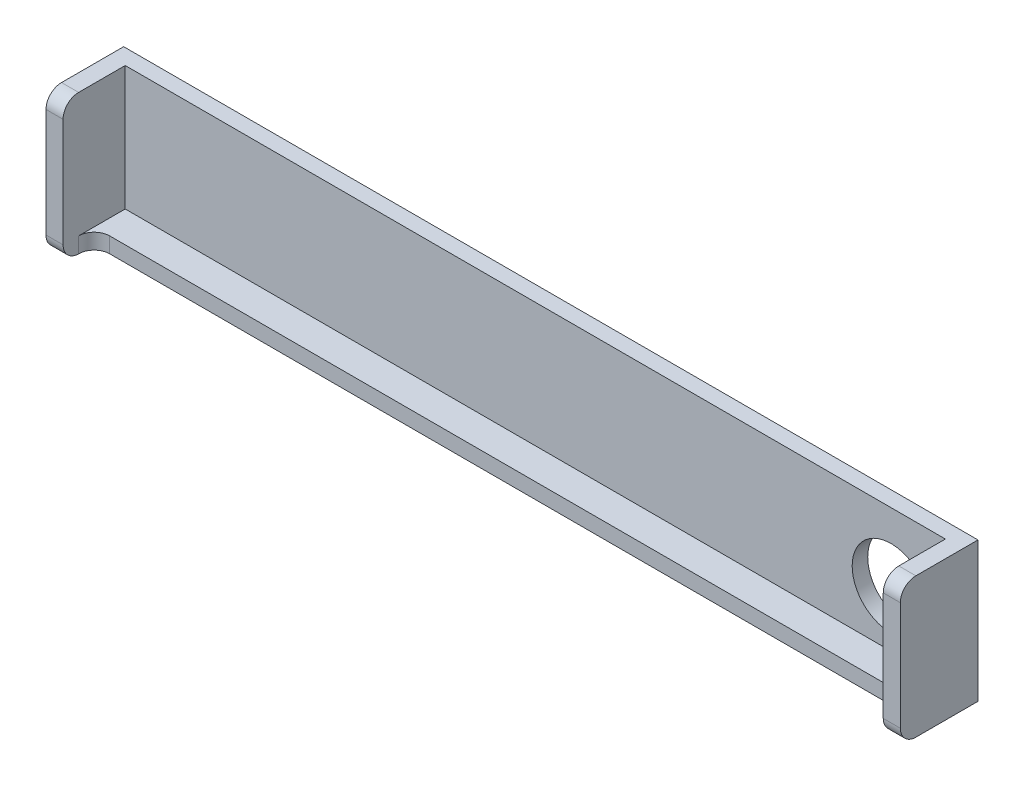
ISO-10303-21;
HEADER;
FILE_DESCRIPTION(('STEP AP214'),'2;1');
FILE_NAME('part.step','',(''),(''),'','','');
FILE_SCHEMA(('AUTOMOTIVE_DESIGN { 1 0 10303 214 1 1 1 1 }'));
ENDSEC;
DATA;
#1=APPLICATION_CONTEXT('core data for automotive mechanical design processes');
#2=APPLICATION_PROTOCOL_DEFINITION('international standard','automotive_design',2000,#1);
#3=PRODUCT_CONTEXT('',#1,'mechanical');
#4=PRODUCT('Part','Part','',(#3));
#5=PRODUCT_RELATED_PRODUCT_CATEGORY('part','',(#4));
#6=PRODUCT_DEFINITION_FORMATION('','',#4);
#7=PRODUCT_DEFINITION_CONTEXT('part definition',#1,'design');
#8=PRODUCT_DEFINITION('design','',#6,#7);
#9=PRODUCT_DEFINITION_SHAPE('','',#8);
#10=(LENGTH_UNIT() NAMED_UNIT(*) SI_UNIT(.MILLI.,.METRE.));
#11=(NAMED_UNIT(*) PLANE_ANGLE_UNIT() SI_UNIT($,.RADIAN.));
#12=(NAMED_UNIT(*) SI_UNIT($,.STERADIAN.) SOLID_ANGLE_UNIT());
#13=UNCERTAINTY_MEASURE_WITH_UNIT(LENGTH_MEASURE(1.E-05),#10,'distance_accuracy_value','');
#14=(GEOMETRIC_REPRESENTATION_CONTEXT(3) GLOBAL_UNCERTAINTY_ASSIGNED_CONTEXT((#13)) GLOBAL_UNIT_ASSIGNED_CONTEXT((#10,
#11,#12)) REPRESENTATION_CONTEXT('',''));
#15=CARTESIAN_POINT('',(0.,0.,0.));
#16=DIRECTION('',(0.,0.,1.));
#17=DIRECTION('',(1.,0.,0.));
#18=AXIS2_PLACEMENT_3D('',#15,#16,#17);
#19=CARTESIAN_POINT('',(0.,18.,2.));
#20=DIRECTION('',(0.,0.,-1.));
#21=DIRECTION('',(-1.,0.,0.));
#22=AXIS2_PLACEMENT_3D('',#19,#20,#21);
#23=PLANE('',#22);
#24=CARTESIAN_POINT('',(100.8,9.,2.));
#25=DIRECTION('',(0.,0.,-1.));
#26=DIRECTION('',(-1.,0.,0.));
#27=AXIS2_PLACEMENT_3D('',#24,#25,#26);
#28=CIRCLE('',#27,5.);
#29=CARTESIAN_POINT('',(95.8,9.,2.));
#30=VERTEX_POINT('',#29);
#31=EDGE_CURVE('E165',#30,#30,#28,.T.);
#32=ORIENTED_EDGE('',*,*,#31,.T.);
#33=EDGE_LOOP('',(#32));
#34=FACE_BOUND('',#33,.T.);
#35=DIRECTION('',(0.,-1.,0.));
#36=VECTOR('',#35,1.);
#37=CARTESIAN_POINT('',(107.8,18.,2.));
#38=LINE('',#37,#36);
#39=CARTESIAN_POINT('',(107.8,18.,2.));
#40=VERTEX_POINT('',#39);
#41=CARTESIAN_POINT('',(107.8,2.,2.));
#42=VERTEX_POINT('',#41);
#43=EDGE_CURVE('E144',#40,#42,#38,.T.);
#44=ORIENTED_EDGE('',*,*,#43,.F.);
#45=DIRECTION('',(-1.,0.,0.));
#46=VECTOR('',#45,1.);
#47=CARTESIAN_POINT('',(0.,18.,2.));
#48=LINE('',#47,#46);
#49=CARTESIAN_POINT('',(2.2,18.,2.));
#50=VERTEX_POINT('',#49);
#51=EDGE_CURVE('E152',#40,#50,#48,.T.);
#52=ORIENTED_EDGE('',*,*,#51,.T.);
#53=DIRECTION('',(0.,1.,0.));
#54=VECTOR('',#53,1.);
#55=CARTESIAN_POINT('',(2.2,18.,2.));
#56=LINE('',#55,#54);
#57=CARTESIAN_POINT('',(2.2,2.,2.));
#58=VERTEX_POINT('',#57);
#59=EDGE_CURVE('E175',#58,#50,#56,.T.);
#60=ORIENTED_EDGE('',*,*,#59,.F.);
#61=DIRECTION('',(-1.,0.,0.));
#62=VECTOR('',#61,1.);
#63=CARTESIAN_POINT('',(0.,2.,2.));
#64=LINE('',#63,#62);
#65=EDGE_CURVE('E163',#42,#58,#64,.T.);
#66=ORIENTED_EDGE('',*,*,#65,.F.);
#67=EDGE_LOOP('',(#44,#52,#60,#66));
#68=FACE_BOUND('',#67,.T.);
#69=ADVANCED_FACE('F33',(#34,#68),#23,.F.);
#70=CARTESIAN_POINT('',(0.,2.,6.));
#71=DIRECTION('',(0.,-1.,0.));
#72=DIRECTION('',(0.,0.,-1.));
#73=AXIS2_PLACEMENT_3D('',#70,#71,#72);
#74=PLANE('',#73);
#75=DIRECTION('',(0.,0.,1.));
#76=VECTOR('',#75,1.);
#77=CARTESIAN_POINT('',(107.8,2.,6.));
#78=LINE('',#77,#76);
#79=CARTESIAN_POINT('',(107.8,2.,8.));
#80=VERTEX_POINT('',#79);
#81=EDGE_CURVE('E148',#42,#80,#78,.T.);
#82=ORIENTED_EDGE('',*,*,#81,.F.);
#83=ORIENTED_EDGE('',*,*,#65,.T.);
#84=DIRECTION('',(0.,0.,-1.));
#85=VECTOR('',#84,1.);
#86=CARTESIAN_POINT('',(2.2,2.,6.));
#87=LINE('',#86,#85);
#88=CARTESIAN_POINT('',(2.2,2.,8.));
#89=VERTEX_POINT('',#88);
#90=EDGE_CURVE('E184',#89,#58,#87,.T.);
#91=ORIENTED_EDGE('',*,*,#90,.F.);
#92=CARTESIAN_POINT('',(4.2,2.,8.));
#93=DIRECTION('',(0.,-1.,0.));
#94=DIRECTION('',(0.,0.,-1.));
#95=AXIS2_PLACEMENT_3D('',#92,#93,#94);
#96=CIRCLE('',#95,2.);
#97=CARTESIAN_POINT('',(4.2,2.,6.));
#98=VERTEX_POINT('',#97);
#99=EDGE_CURVE('E41',#89,#98,#96,.T.);
#100=ORIENTED_EDGE('',*,*,#99,.T.);
#101=DIRECTION('',(-1.,0.,0.));
#102=VECTOR('',#101,1.);
#103=CARTESIAN_POINT('',(0.,2.,6.));
#104=LINE('',#103,#102);
#105=CARTESIAN_POINT('',(105.8,2.,6.));
#106=VERTEX_POINT('',#105);
#107=EDGE_CURVE('E189',#106,#98,#104,.T.);
#108=ORIENTED_EDGE('',*,*,#107,.F.);
#109=CARTESIAN_POINT('',(105.8,2.,8.));
#110=DIRECTION('',(0.,-1.,0.));
#111=DIRECTION('',(0.,0.,-1.));
#112=AXIS2_PLACEMENT_3D('',#109,#110,#111);
#113=CIRCLE('',#112,2.);
#114=EDGE_CURVE('E247',#106,#80,#113,.T.);
#115=ORIENTED_EDGE('',*,*,#114,.T.);
#116=EDGE_LOOP('',(#82,#83,#91,#100,#108,#115));
#117=FACE_BOUND('',#116,.T.);
#118=ADVANCED_FACE('F251',(#117),#74,.F.);
#119=CARTESIAN_POINT('',(0.,2.,6.));
#120=DIRECTION('',(0.,0.,-1.));
#121=DIRECTION('',(-1.,0.,0.));
#122=AXIS2_PLACEMENT_3D('',#119,#120,#121);
#123=PLANE('',#122);
#124=DIRECTION('',(1.,0.,0.));
#125=VECTOR('',#124,1.);
#126=CARTESIAN_POINT('',(0.,0.,6.));
#127=LINE('',#126,#125);
#128=CARTESIAN_POINT('',(4.2,0.,6.));
#129=VERTEX_POINT('',#128);
#130=CARTESIAN_POINT('',(105.8,0.,6.));
#131=VERTEX_POINT('',#130);
#132=EDGE_CURVE('E187',#129,#131,#127,.T.);
#133=ORIENTED_EDGE('',*,*,#132,.T.);
#134=DIRECTION('',(0.,-1.,0.));
#135=VECTOR('',#134,1.);
#136=CARTESIAN_POINT('',(105.8,2.,6.));
#137=LINE('',#136,#135);
#138=EDGE_CURVE('E54',#131,#106,#137,.F.);
#139=ORIENTED_EDGE('',*,*,#138,.T.);
#140=ORIENTED_EDGE('',*,*,#107,.T.);
#141=DIRECTION('',(0.,1.,0.));
#142=VECTOR('',#141,1.);
#143=CARTESIAN_POINT('',(4.2,0.,6.));
#144=LINE('',#143,#142);
#145=EDGE_CURVE('E242',#98,#129,#144,.F.);
#146=ORIENTED_EDGE('',*,*,#145,.T.);
#147=EDGE_LOOP('',(#133,#139,#140,#146));
#148=FACE_BOUND('',#147,.T.);
#149=ADVANCED_FACE('F317',(#148),#123,.F.);
#150=CARTESIAN_POINT('',(0.,0.,2.));
#151=DIRECTION('',(1.,0.,0.));
#152=DIRECTION('',(0.,0.,-1.));
#153=AXIS2_PLACEMENT_3D('',#150,#151,#152);
#154=PLANE('',#153);
#155=DIRECTION('',(0.,-1.,0.));
#156=VECTOR('',#155,1.);
#157=CARTESIAN_POINT('',(0.,18.,10.));
#158=LINE('',#157,#156);
#159=CARTESIAN_POINT('',(0.,16.,10.));
#160=VERTEX_POINT('',#159);
#161=CARTESIAN_POINT('',(0.,2.,10.));
#162=VERTEX_POINT('',#161);
#163=EDGE_CURVE('E176',#160,#162,#158,.T.);
#164=ORIENTED_EDGE('',*,*,#163,.F.);
#165=CARTESIAN_POINT('',(0.,16.,8.));
#166=DIRECTION('',(1.,0.,0.));
#167=DIRECTION('',(0.,0.,-1.));
#168=AXIS2_PLACEMENT_3D('',#165,#166,#167);
#169=CIRCLE('',#168,2.);
#170=CARTESIAN_POINT('',(0.,18.,8.));
#171=VERTEX_POINT('',#170);
#172=EDGE_CURVE('E232',#160,#171,#169,.F.);
#173=ORIENTED_EDGE('',*,*,#172,.T.);
#174=DIRECTION('',(0.,0.,-1.));
#175=VECTOR('',#174,1.);
#176=CARTESIAN_POINT('',(0.,18.,2.));
#177=LINE('',#176,#175);
#178=CARTESIAN_POINT('',(0.,18.,0.));
#179=VERTEX_POINT('',#178);
#180=EDGE_CURVE('E159',#171,#179,#177,.T.);
#181=ORIENTED_EDGE('',*,*,#180,.T.);
#182=DIRECTION('',(0.,-1.,0.));
#183=VECTOR('',#182,1.);
#184=CARTESIAN_POINT('',(0.,0.,0.));
#185=LINE('',#184,#183);
#186=CARTESIAN_POINT('',(0.,0.,0.));
#187=VERTEX_POINT('',#186);
#188=EDGE_CURVE('E191',#179,#187,#185,.T.);
#189=ORIENTED_EDGE('',*,*,#188,.T.);
#190=DIRECTION('',(0.,0.,-1.));
#191=VECTOR('',#190,1.);
#192=CARTESIAN_POINT('',(0.,0.,2.));
#193=LINE('',#192,#191);
#194=CARTESIAN_POINT('',(0.,0.,8.));
#195=VERTEX_POINT('',#194);
#196=EDGE_CURVE('E197',#195,#187,#193,.T.);
#197=ORIENTED_EDGE('',*,*,#196,.F.);
#198=CARTESIAN_POINT('',(0.,2.,8.));
#199=DIRECTION('',(1.,0.,0.));
#200=DIRECTION('',(0.,0.,-1.));
#201=AXIS2_PLACEMENT_3D('',#198,#199,#200);
#202=CIRCLE('',#201,2.);
#203=EDGE_CURVE('E230',#195,#162,#202,.F.);
#204=ORIENTED_EDGE('',*,*,#203,.T.);
#205=EDGE_LOOP('',(#164,#173,#181,#189,#197,#204));
#206=FACE_BOUND('',#205,.T.);
#207=ADVANCED_FACE('F299',(#206),#154,.F.);
#208=CARTESIAN_POINT('',(0.,0.,2.));
#209=DIRECTION('',(0.,1.,0.));
#210=DIRECTION('',(0.,0.,1.));
#211=AXIS2_PLACEMENT_3D('',#208,#209,#210);
#212=PLANE('',#211);
#213=DIRECTION('',(0.,0.,-1.));
#214=VECTOR('',#213,1.);
#215=CARTESIAN_POINT('',(110.,0.,2.));
#216=LINE('',#215,#214);
#217=CARTESIAN_POINT('',(110.,0.,8.));
#218=VERTEX_POINT('',#217);
#219=CARTESIAN_POINT('',(110.,0.,0.));
#220=VERTEX_POINT('',#219);
#221=EDGE_CURVE('E262',#218,#220,#216,.T.);
#222=ORIENTED_EDGE('',*,*,#221,.F.);
#223=DIRECTION('',(1.,0.,0.));
#224=VECTOR('',#223,1.);
#225=CARTESIAN_POINT('',(0.,0.,8.));
#226=LINE('',#225,#224);
#227=CARTESIAN_POINT('',(107.8,0.,8.));
#228=VERTEX_POINT('',#227);
#229=EDGE_CURVE('E211',#218,#228,#226,.F.);
#230=ORIENTED_EDGE('',*,*,#229,.T.);
#231=CARTESIAN_POINT('',(105.8,0.,8.));
#232=DIRECTION('',(0.,1.,0.));
#233=DIRECTION('',(0.,0.,1.));
#234=AXIS2_PLACEMENT_3D('',#231,#232,#233);
#235=CIRCLE('',#234,2.);
#236=EDGE_CURVE('E245',#228,#131,#235,.T.);
#237=ORIENTED_EDGE('',*,*,#236,.T.);
#238=ORIENTED_EDGE('',*,*,#132,.F.);
#239=CARTESIAN_POINT('',(4.2,0.,8.));
#240=DIRECTION('',(0.,1.,0.));
#241=DIRECTION('',(0.,0.,1.));
#242=AXIS2_PLACEMENT_3D('',#239,#240,#241);
#243=CIRCLE('',#242,2.);
#244=CARTESIAN_POINT('',(2.2,0.,8.));
#245=VERTEX_POINT('',#244);
#246=EDGE_CURVE('E11',#129,#245,#243,.T.);
#247=ORIENTED_EDGE('',*,*,#246,.T.);
#248=DIRECTION('',(1.,0.,0.));
#249=VECTOR('',#248,1.);
#250=CARTESIAN_POINT('',(0.,0.,8.));
#251=LINE('',#250,#249);
#252=EDGE_CURVE('E209',#245,#195,#251,.F.);
#253=ORIENTED_EDGE('',*,*,#252,.T.);
#254=ORIENTED_EDGE('',*,*,#196,.T.);
#255=DIRECTION('',(1.,0.,0.));
#256=VECTOR('',#255,1.);
#257=CARTESIAN_POINT('',(0.,0.,0.));
#258=LINE('',#257,#256);
#259=EDGE_CURVE('E287',#187,#220,#258,.T.);
#260=ORIENTED_EDGE('',*,*,#259,.T.);
#261=EDGE_LOOP('',(#222,#230,#237,#238,#247,#253,#254,#260));
#262=FACE_BOUND('',#261,.T.);
#263=ADVANCED_FACE('F259',(#262),#212,.F.);
#264=CARTESIAN_POINT('',(110.,0.,2.));
#265=DIRECTION('',(-1.,0.,0.));
#266=DIRECTION('',(0.,0.,1.));
#267=AXIS2_PLACEMENT_3D('',#264,#265,#266);
#268=PLANE('',#267);
#269=DIRECTION('',(0.,1.,0.));
#270=VECTOR('',#269,1.);
#271=CARTESIAN_POINT('',(110.,18.,10.));
#272=LINE('',#271,#270);
#273=CARTESIAN_POINT('',(110.,2.,10.));
#274=VERTEX_POINT('',#273);
#275=CARTESIAN_POINT('',(110.,16.,10.));
#276=VERTEX_POINT('',#275);
#277=EDGE_CURVE('E164',#274,#276,#272,.T.);
#278=ORIENTED_EDGE('',*,*,#277,.F.);
#279=CARTESIAN_POINT('',(110.,2.,8.));
#280=DIRECTION('',(-1.,0.,0.));
#281=DIRECTION('',(0.,0.,1.));
#282=AXIS2_PLACEMENT_3D('',#279,#280,#281);
#283=CIRCLE('',#282,2.);
#284=EDGE_CURVE('E207',#274,#218,#283,.F.);
#285=ORIENTED_EDGE('',*,*,#284,.T.);
#286=ORIENTED_EDGE('',*,*,#221,.T.);
#287=DIRECTION('',(0.,1.,0.));
#288=VECTOR('',#287,1.);
#289=CARTESIAN_POINT('',(110.,0.,0.));
#290=LINE('',#289,#288);
#291=CARTESIAN_POINT('',(110.,18.,0.));
#292=VERTEX_POINT('',#291);
#293=EDGE_CURVE('E284',#220,#292,#290,.T.);
#294=ORIENTED_EDGE('',*,*,#293,.T.);
#295=DIRECTION('',(0.,0.,-1.));
#296=VECTOR('',#295,1.);
#297=CARTESIAN_POINT('',(110.,18.,2.));
#298=LINE('',#297,#296);
#299=CARTESIAN_POINT('',(110.,18.,8.));
#300=VERTEX_POINT('',#299);
#301=EDGE_CURVE('E275',#300,#292,#298,.T.);
#302=ORIENTED_EDGE('',*,*,#301,.F.);
#303=CARTESIAN_POINT('',(110.,16.,8.));
#304=DIRECTION('',(-1.,0.,0.));
#305=DIRECTION('',(0.,0.,1.));
#306=AXIS2_PLACEMENT_3D('',#303,#304,#305);
#307=CIRCLE('',#306,2.);
#308=EDGE_CURVE('E205',#300,#276,#307,.F.);
#309=ORIENTED_EDGE('',*,*,#308,.T.);
#310=EDGE_LOOP('',(#278,#285,#286,#294,#302,#309));
#311=FACE_BOUND('',#310,.T.);
#312=ADVANCED_FACE('F271',(#311),#268,.F.);
#313=CARTESIAN_POINT('',(0.,18.,2.));
#314=DIRECTION('',(0.,-1.,0.));
#315=DIRECTION('',(0.,0.,-1.));
#316=AXIS2_PLACEMENT_3D('',#313,#314,#315);
#317=PLANE('',#316);
#318=DIRECTION('',(0.,0.,-1.));
#319=VECTOR('',#318,1.);
#320=CARTESIAN_POINT('',(107.8,18.,10.));
#321=LINE('',#320,#319);
#322=CARTESIAN_POINT('',(107.8,18.,8.));
#323=VERTEX_POINT('',#322);
#324=EDGE_CURVE('E139',#323,#40,#321,.T.);
#325=ORIENTED_EDGE('',*,*,#324,.F.);
#326=DIRECTION('',(-1.,0.,0.));
#327=VECTOR('',#326,1.);
#328=CARTESIAN_POINT('',(0.,18.,8.));
#329=LINE('',#328,#327);
#330=EDGE_CURVE('E222',#323,#300,#329,.F.);
#331=ORIENTED_EDGE('',*,*,#330,.T.);
#332=ORIENTED_EDGE('',*,*,#301,.T.);
#333=DIRECTION('',(-1.,0.,0.));
#334=VECTOR('',#333,1.);
#335=CARTESIAN_POINT('',(0.,18.,0.));
#336=LINE('',#335,#334);
#337=EDGE_CURVE('E160',#292,#179,#336,.T.);
#338=ORIENTED_EDGE('',*,*,#337,.T.);
#339=ORIENTED_EDGE('',*,*,#180,.F.);
#340=DIRECTION('',(-1.,0.,0.));
#341=VECTOR('',#340,1.);
#342=CARTESIAN_POINT('',(2.2,18.,8.));
#343=LINE('',#342,#341);
#344=CARTESIAN_POINT('',(2.2,18.,8.));
#345=VERTEX_POINT('',#344);
#346=EDGE_CURVE('E220',#171,#345,#343,.F.);
#347=ORIENTED_EDGE('',*,*,#346,.T.);
#348=DIRECTION('',(0.,0.,-1.));
#349=VECTOR('',#348,1.);
#350=CARTESIAN_POINT('',(2.2,18.,10.));
#351=LINE('',#350,#349);
#352=EDGE_CURVE('E155',#345,#50,#351,.T.);
#353=ORIENTED_EDGE('',*,*,#352,.T.);
#354=ORIENTED_EDGE('',*,*,#51,.F.);
#355=EDGE_LOOP('',(#325,#331,#332,#338,#339,#347,#353,#354));
#356=FACE_BOUND('',#355,.T.);
#357=ADVANCED_FACE('F153',(#356),#317,.F.);
#358=CARTESIAN_POINT('',(0.,18.,0.));
#359=DIRECTION('',(0.,0.,-1.));
#360=DIRECTION('',(-1.,0.,0.));
#361=AXIS2_PLACEMENT_3D('',#358,#359,#360);
#362=PLANE('',#361);
#363=CARTESIAN_POINT('',(100.8,9.,0.));
#364=DIRECTION('',(0.,0.,-1.));
#365=DIRECTION('',(-1.,0.,0.));
#366=AXIS2_PLACEMENT_3D('',#363,#364,#365);
#367=CIRCLE('',#366,5.);
#368=CARTESIAN_POINT('',(95.8,9.,0.));
#369=VERTEX_POINT('',#368);
#370=EDGE_CURVE('E170',#369,#369,#367,.T.);
#371=ORIENTED_EDGE('',*,*,#370,.F.);
#372=EDGE_LOOP('',(#371));
#373=FACE_BOUND('',#372,.T.);
#374=ORIENTED_EDGE('',*,*,#188,.F.);
#375=ORIENTED_EDGE('',*,*,#337,.F.);
#376=ORIENTED_EDGE('',*,*,#293,.F.);
#377=ORIENTED_EDGE('',*,*,#259,.F.);
#378=EDGE_LOOP('',(#374,#375,#376,#377));
#379=FACE_BOUND('',#378,.T.);
#380=ADVANCED_FACE('F289',(#373,#379),#362,.T.);
#381=CARTESIAN_POINT('',(2.2,18.,10.));
#382=DIRECTION('',(-1.,0.,0.));
#383=DIRECTION('',(0.,-1.,0.));
#384=AXIS2_PLACEMENT_3D('',#381,#382,#383);
#385=PLANE('',#384);
#386=ORIENTED_EDGE('',*,*,#352,.F.);
#387=CARTESIAN_POINT('',(2.2,16.,8.));
#388=DIRECTION('',(-1.,0.,0.));
#389=DIRECTION('',(0.,-1.,0.));
#390=AXIS2_PLACEMENT_3D('',#387,#388,#389);
#391=CIRCLE('',#390,2.);
#392=CARTESIAN_POINT('',(2.2,16.,10.));
#393=VERTEX_POINT('',#392);
#394=EDGE_CURVE('E240',#345,#393,#391,.F.);
#395=ORIENTED_EDGE('',*,*,#394,.T.);
#396=DIRECTION('',(0.,1.,0.));
#397=VECTOR('',#396,1.);
#398=CARTESIAN_POINT('',(2.2,18.,10.));
#399=LINE('',#398,#397);
#400=CARTESIAN_POINT('',(2.2,2.,10.));
#401=VERTEX_POINT('',#400);
#402=EDGE_CURVE('E179',#401,#393,#399,.T.);
#403=ORIENTED_EDGE('',*,*,#402,.F.);
#404=CARTESIAN_POINT('',(2.2,2.,8.));
#405=DIRECTION('',(-1.,0.,0.));
#406=DIRECTION('',(0.,-1.,0.));
#407=AXIS2_PLACEMENT_3D('',#404,#405,#406);
#408=CIRCLE('',#407,2.);
#409=EDGE_CURVE('E237',#401,#245,#408,.F.);
#410=ORIENTED_EDGE('',*,*,#409,.T.);
#411=DIRECTION('',(0.,1.,0.));
#412=VECTOR('',#411,1.);
#413=CARTESIAN_POINT('',(2.2,2.,8.));
#414=LINE('',#413,#412);
#415=EDGE_CURVE('E234',#245,#89,#414,.T.);
#416=ORIENTED_EDGE('',*,*,#415,.T.);
#417=ORIENTED_EDGE('',*,*,#90,.T.);
#418=ORIENTED_EDGE('',*,*,#59,.T.);
#419=EDGE_LOOP('',(#386,#395,#403,#410,#416,#417,#418));
#420=FACE_BOUND('',#419,.T.);
#421=ADVANCED_FACE('F307',(#420),#385,.F.);
#422=CARTESIAN_POINT('',(0.,0.,10.));
#423=DIRECTION('',(0.,0.,1.));
#424=DIRECTION('',(1.,0.,0.));
#425=AXIS2_PLACEMENT_3D('',#422,#423,#424);
#426=PLANE('',#425);
#427=ORIENTED_EDGE('',*,*,#402,.T.);
#428=DIRECTION('',(-1.,0.,0.));
#429=VECTOR('',#428,1.);
#430=CARTESIAN_POINT('',(0.,16.,10.));
#431=LINE('',#430,#429);
#432=EDGE_CURVE('E227',#393,#160,#431,.T.);
#433=ORIENTED_EDGE('',*,*,#432,.T.);
#434=ORIENTED_EDGE('',*,*,#163,.T.);
#435=DIRECTION('',(1.,0.,0.));
#436=VECTOR('',#435,1.);
#437=CARTESIAN_POINT('',(2.2,2.,10.));
#438=LINE('',#437,#436);
#439=EDGE_CURVE('E224',#162,#401,#438,.T.);
#440=ORIENTED_EDGE('',*,*,#439,.T.);
#441=EDGE_LOOP('',(#427,#433,#434,#440));
#442=FACE_BOUND('',#441,.T.);
#443=ADVANCED_FACE('F309',(#442),#426,.T.);
#444=CARTESIAN_POINT('',(107.8,18.,10.));
#445=DIRECTION('',(1.,0.,0.));
#446=DIRECTION('',(0.,0.,-1.));
#447=AXIS2_PLACEMENT_3D('',#444,#445,#446);
#448=PLANE('',#447);
#449=DIRECTION('',(0.,-1.,0.));
#450=VECTOR('',#449,1.);
#451=CARTESIAN_POINT('',(107.8,18.,10.));
#452=LINE('',#451,#450);
#453=CARTESIAN_POINT('',(107.8,16.,10.));
#454=VERTEX_POINT('',#453);
#455=CARTESIAN_POINT('',(107.8,2.,10.));
#456=VERTEX_POINT('',#455);
#457=EDGE_CURVE('E149',#454,#456,#452,.T.);
#458=ORIENTED_EDGE('',*,*,#457,.F.);
#459=CARTESIAN_POINT('',(107.8,16.,8.));
#460=DIRECTION('',(1.,0.,0.));
#461=DIRECTION('',(0.,0.,-1.));
#462=AXIS2_PLACEMENT_3D('',#459,#460,#461);
#463=CIRCLE('',#462,2.);
#464=EDGE_CURVE('E145',#454,#323,#463,.F.);
#465=ORIENTED_EDGE('',*,*,#464,.T.);
#466=ORIENTED_EDGE('',*,*,#324,.T.);
#467=ORIENTED_EDGE('',*,*,#43,.T.);
#468=ORIENTED_EDGE('',*,*,#81,.T.);
#469=DIRECTION('',(0.,-1.,0.));
#470=VECTOR('',#469,1.);
#471=CARTESIAN_POINT('',(107.8,0.,8.));
#472=LINE('',#471,#470);
#473=EDGE_CURVE('E214',#80,#228,#472,.T.);
#474=ORIENTED_EDGE('',*,*,#473,.T.);
#475=CARTESIAN_POINT('',(107.8,2.,8.));
#476=DIRECTION('',(1.,0.,0.));
#477=DIRECTION('',(0.,0.,-1.));
#478=AXIS2_PLACEMENT_3D('',#475,#476,#477);
#479=CIRCLE('',#478,2.);
#480=EDGE_CURVE('E217',#228,#456,#479,.F.);
#481=ORIENTED_EDGE('',*,*,#480,.T.);
#482=EDGE_LOOP('',(#458,#465,#466,#467,#468,#474,#481));
#483=FACE_BOUND('',#482,.T.);
#484=ADVANCED_FACE('F142',(#483),#448,.F.);
#485=CARTESIAN_POINT('',(110.,0.,10.));
#486=DIRECTION('',(0.,0.,-1.));
#487=DIRECTION('',(-1.,0.,0.));
#488=AXIS2_PLACEMENT_3D('',#485,#486,#487);
#489=PLANE('',#488);
#490=ORIENTED_EDGE('',*,*,#457,.T.);
#491=DIRECTION('',(1.,0.,0.));
#492=VECTOR('',#491,1.);
#493=CARTESIAN_POINT('',(110.,2.,10.));
#494=LINE('',#493,#492);
#495=EDGE_CURVE('E202',#456,#274,#494,.T.);
#496=ORIENTED_EDGE('',*,*,#495,.T.);
#497=ORIENTED_EDGE('',*,*,#277,.T.);
#498=DIRECTION('',(-1.,0.,0.));
#499=VECTOR('',#498,1.);
#500=CARTESIAN_POINT('',(110.,16.,10.));
#501=LINE('',#500,#499);
#502=EDGE_CURVE('E199',#276,#454,#501,.T.);
#503=ORIENTED_EDGE('',*,*,#502,.T.);
#504=EDGE_LOOP('',(#490,#496,#497,#503));
#505=FACE_BOUND('',#504,.T.);
#506=ADVANCED_FACE('F268',(#505),#489,.F.);
#507=CARTESIAN_POINT('',(110.,2.,8.));
#508=DIRECTION('',(1.,0.,0.));
#509=DIRECTION('',(0.,0.,-1.));
#510=AXIS2_PLACEMENT_3D('',#507,#508,#509);
#511=CYLINDRICAL_SURFACE('',#510,2.);
#512=ORIENTED_EDGE('',*,*,#480,.F.);
#513=ORIENTED_EDGE('',*,*,#229,.F.);
#514=ORIENTED_EDGE('',*,*,#284,.F.);
#515=ORIENTED_EDGE('',*,*,#495,.F.);
#516=EDGE_LOOP('',(#512,#513,#514,#515));
#517=FACE_BOUND('',#516,.T.);
#518=ADVANCED_FACE('F265',(#517),#511,.T.);
#519=CARTESIAN_POINT('',(110.,16.,8.));
#520=DIRECTION('',(-1.,0.,0.));
#521=DIRECTION('',(0.,0.,1.));
#522=AXIS2_PLACEMENT_3D('',#519,#520,#521);
#523=CYLINDRICAL_SURFACE('',#522,2.);
#524=ORIENTED_EDGE('',*,*,#308,.F.);
#525=ORIENTED_EDGE('',*,*,#330,.F.);
#526=ORIENTED_EDGE('',*,*,#464,.F.);
#527=ORIENTED_EDGE('',*,*,#502,.F.);
#528=EDGE_LOOP('',(#524,#525,#526,#527));
#529=FACE_BOUND('',#528,.T.);
#530=ADVANCED_FACE('F277',(#529),#523,.T.);
#531=CARTESIAN_POINT('',(0.,16.,8.));
#532=DIRECTION('',(1.,0.,0.));
#533=DIRECTION('',(0.,0.,-1.));
#534=AXIS2_PLACEMENT_3D('',#531,#532,#533);
#535=CYLINDRICAL_SURFACE('',#534,2.);
#536=ORIENTED_EDGE('',*,*,#394,.F.);
#537=ORIENTED_EDGE('',*,*,#346,.F.);
#538=ORIENTED_EDGE('',*,*,#172,.F.);
#539=ORIENTED_EDGE('',*,*,#432,.F.);
#540=EDGE_LOOP('',(#536,#537,#538,#539));
#541=FACE_BOUND('',#540,.T.);
#542=ADVANCED_FACE('F303',(#541),#535,.T.);
#543=CARTESIAN_POINT('',(0.,2.,8.));
#544=DIRECTION('',(-1.,0.,0.));
#545=DIRECTION('',(0.,0.,1.));
#546=AXIS2_PLACEMENT_3D('',#543,#544,#545);
#547=CYLINDRICAL_SURFACE('',#546,2.);
#548=ORIENTED_EDGE('',*,*,#203,.F.);
#549=ORIENTED_EDGE('',*,*,#252,.F.);
#550=ORIENTED_EDGE('',*,*,#409,.F.);
#551=ORIENTED_EDGE('',*,*,#439,.F.);
#552=EDGE_LOOP('',(#548,#549,#550,#551));
#553=FACE_BOUND('',#552,.T.);
#554=ADVANCED_FACE('F312',(#553),#547,.T.);
#555=CARTESIAN_POINT('',(105.8,18.,8.));
#556=DIRECTION('',(0.,1.,0.));
#557=DIRECTION('',(0.,0.,1.));
#558=AXIS2_PLACEMENT_3D('',#555,#556,#557);
#559=CYLINDRICAL_SURFACE('',#558,2.);
#560=ORIENTED_EDGE('',*,*,#114,.F.);
#561=ORIENTED_EDGE('',*,*,#138,.F.);
#562=ORIENTED_EDGE('',*,*,#236,.F.);
#563=ORIENTED_EDGE('',*,*,#473,.F.);
#564=EDGE_LOOP('',(#560,#561,#562,#563));
#565=FACE_BOUND('',#564,.T.);
#566=ADVANCED_FACE('F253',(#565),#559,.F.);
#567=CARTESIAN_POINT('',(4.2,18.,8.));
#568=DIRECTION('',(0.,-1.,0.));
#569=DIRECTION('',(1.,0.,0.));
#570=AXIS2_PLACEMENT_3D('',#567,#568,#569);
#571=CYLINDRICAL_SURFACE('',#570,2.);
#572=ORIENTED_EDGE('',*,*,#246,.F.);
#573=ORIENTED_EDGE('',*,*,#145,.F.);
#574=ORIENTED_EDGE('',*,*,#99,.F.);
#575=ORIENTED_EDGE('',*,*,#415,.F.);
#576=EDGE_LOOP('',(#572,#573,#574,#575));
#577=FACE_BOUND('',#576,.T.);
#578=ADVANCED_FACE('F35',(#577),#571,.F.);
#579=CARTESIAN_POINT('',(100.8,9.,10.));
#580=DIRECTION('',(0.,0.,-1.));
#581=DIRECTION('',(-1.,0.,0.));
#582=AXIS2_PLACEMENT_3D('',#579,#580,#581);
#583=CYLINDRICAL_SURFACE('',#582,5.);
#584=ORIENTED_EDGE('',*,*,#370,.T.);
#585=EDGE_LOOP('',(#584));
#586=FACE_BOUND('',#585,.T.);
#587=ORIENTED_EDGE('',*,*,#31,.F.);
#588=EDGE_LOOP('',(#587));
#589=FACE_BOUND('',#588,.T.);
#590=ADVANCED_FACE('F353',(#586,#589),#583,.F.);
#591=CLOSED_SHELL('',(#69,#118,#149,#207,#263,#312,#357,#380,#421,#443,#484,#506,#518,#530,#542,
#554,#566,#578,#590));
#592=MANIFOLD_SOLID_BREP('B2',#591);
#593=ADVANCED_BREP_SHAPE_REPRESENTATION('',(#18,#592),#14);
#594=SHAPE_DEFINITION_REPRESENTATION(#9,#593);
ENDSEC;
END-ISO-10303-21;
